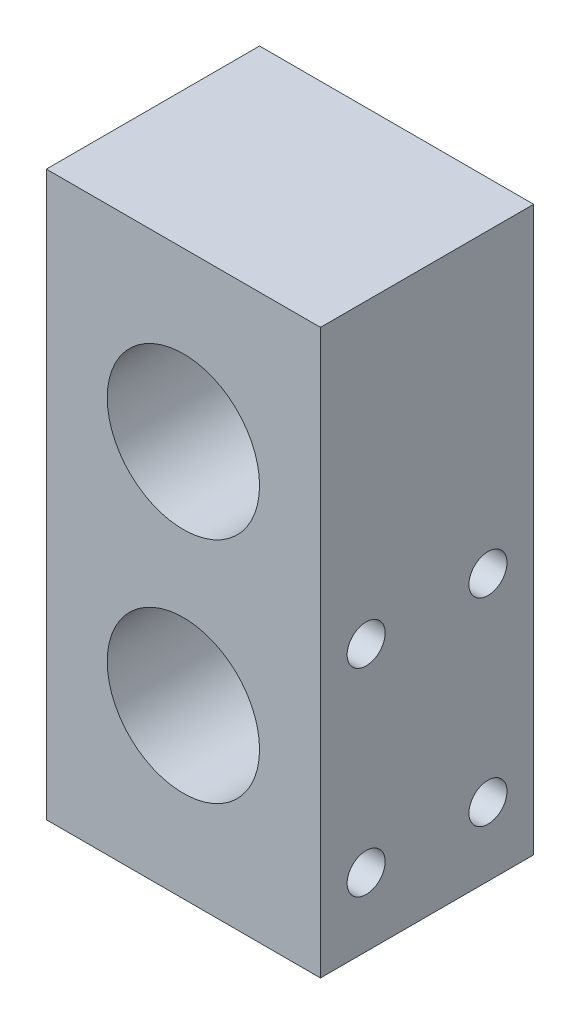
ISO-10303-21;
HEADER;
FILE_DESCRIPTION(('STEP AP214'),'2;1');
FILE_NAME('part.step','',(''),(''),'','','');
FILE_SCHEMA(('AUTOMOTIVE_DESIGN { 1 0 10303 214 1 1 1 1 }'));
ENDSEC;
DATA;
#1=APPLICATION_CONTEXT('core data for automotive mechanical design processes');
#2=APPLICATION_PROTOCOL_DEFINITION('international standard','automotive_design',2000,#1);
#3=PRODUCT_CONTEXT('',#1,'mechanical');
#4=PRODUCT('Part','Part','',(#3));
#5=PRODUCT_RELATED_PRODUCT_CATEGORY('part','',(#4));
#6=PRODUCT_DEFINITION_FORMATION('','',#4);
#7=PRODUCT_DEFINITION_CONTEXT('part definition',#1,'design');
#8=PRODUCT_DEFINITION('design','',#6,#7);
#9=PRODUCT_DEFINITION_SHAPE('','',#8);
#10=(LENGTH_UNIT() NAMED_UNIT(*) SI_UNIT(.MILLI.,.METRE.));
#11=(NAMED_UNIT(*) PLANE_ANGLE_UNIT() SI_UNIT($,.RADIAN.));
#12=(NAMED_UNIT(*) SI_UNIT($,.STERADIAN.) SOLID_ANGLE_UNIT());
#13=UNCERTAINTY_MEASURE_WITH_UNIT(LENGTH_MEASURE(1.E-05),#10,'distance_accuracy_value','');
#14=(GEOMETRIC_REPRESENTATION_CONTEXT(3) GLOBAL_UNCERTAINTY_ASSIGNED_CONTEXT((#13)) GLOBAL_UNIT_ASSIGNED_CONTEXT((#10,
#11,#12)) REPRESENTATION_CONTEXT('',''));
#15=CARTESIAN_POINT('',(0.,0.,0.));
#16=DIRECTION('',(0.,0.,1.));
#17=DIRECTION('',(1.,0.,0.));
#18=AXIS2_PLACEMENT_3D('',#15,#16,#17);
#19=CARTESIAN_POINT('',(9.,37.,7.));
#20=DIRECTION('',(-1.,0.,0.));
#21=DIRECTION('',(0.,0.,1.));
#22=AXIS2_PLACEMENT_3D('',#19,#20,#21);
#23=PLANE('',#22);
#24=CARTESIAN_POINT('',(9.,17.5,-4.));
#25=DIRECTION('',(1.,0.,0.));
#26=DIRECTION('',(0.,0.,-1.));
#27=AXIS2_PLACEMENT_3D('',#24,#25,#26);
#28=CIRCLE('',#27,1.25);
#29=CARTESIAN_POINT('',(9.,17.5,-5.25));
#30=VERTEX_POINT('',#29);
#31=EDGE_CURVE('E128',#30,#30,#28,.T.);
#32=ORIENTED_EDGE('',*,*,#31,.F.);
#33=EDGE_LOOP('',(#32));
#34=FACE_BOUND('',#33,.T.);
#35=CARTESIAN_POINT('',(9.,17.5,4.));
#36=DIRECTION('',(1.,0.,0.));
#37=DIRECTION('',(0.,0.,-1.));
#38=AXIS2_PLACEMENT_3D('',#35,#36,#37);
#39=CIRCLE('',#38,1.25);
#40=CARTESIAN_POINT('',(9.,17.5,2.75));
#41=VERTEX_POINT('',#40);
#42=EDGE_CURVE('E127',#41,#41,#39,.T.);
#43=ORIENTED_EDGE('',*,*,#42,.F.);
#44=EDGE_LOOP('',(#43));
#45=FACE_BOUND('',#44,.T.);
#46=CARTESIAN_POINT('',(9.,4.5,4.));
#47=DIRECTION('',(1.,0.,0.));
#48=DIRECTION('',(0.,0.,-1.));
#49=AXIS2_PLACEMENT_3D('',#46,#47,#48);
#50=CIRCLE('',#49,1.25);
#51=CARTESIAN_POINT('',(9.,4.5,2.75));
#52=VERTEX_POINT('',#51);
#53=EDGE_CURVE('E141',#52,#52,#50,.T.);
#54=ORIENTED_EDGE('',*,*,#53,.F.);
#55=EDGE_LOOP('',(#54));
#56=FACE_BOUND('',#55,.T.);
#57=CARTESIAN_POINT('',(9.,4.5,-4.));
#58=DIRECTION('',(1.,0.,0.));
#59=DIRECTION('',(0.,0.,-1.));
#60=AXIS2_PLACEMENT_3D('',#57,#58,#59);
#61=CIRCLE('',#60,1.25);
#62=CARTESIAN_POINT('',(9.,4.5,-5.25));
#63=VERTEX_POINT('',#62);
#64=EDGE_CURVE('E149',#63,#63,#61,.T.);
#65=ORIENTED_EDGE('',*,*,#64,.F.);
#66=EDGE_LOOP('',(#65));
#67=FACE_BOUND('',#66,.T.);
#68=DIRECTION('',(0.,0.,-1.));
#69=VECTOR('',#68,1.);
#70=CARTESIAN_POINT('',(9.,0.,7.));
#71=LINE('',#70,#69);
#72=CARTESIAN_POINT('',(9.,0.,7.));
#73=VERTEX_POINT('',#72);
#74=CARTESIAN_POINT('',(9.,0.,-7.));
#75=VERTEX_POINT('',#74);
#76=EDGE_CURVE('E194',#73,#75,#71,.T.);
#77=ORIENTED_EDGE('',*,*,#76,.T.);
#78=DIRECTION('',(0.,-1.,0.));
#79=VECTOR('',#78,1.);
#80=CARTESIAN_POINT('',(9.,37.,-7.));
#81=LINE('',#80,#79);
#82=CARTESIAN_POINT('',(9.,37.,-7.));
#83=VERTEX_POINT('',#82);
#84=EDGE_CURVE('E11',#83,#75,#81,.T.);
#85=ORIENTED_EDGE('',*,*,#84,.F.);
#86=DIRECTION('',(0.,0.,-1.));
#87=VECTOR('',#86,1.);
#88=CARTESIAN_POINT('',(9.,37.,7.));
#89=LINE('',#88,#87);
#90=CARTESIAN_POINT('',(9.,37.,7.));
#91=VERTEX_POINT('',#90);
#92=EDGE_CURVE('E206',#91,#83,#89,.T.);
#93=ORIENTED_EDGE('',*,*,#92,.F.);
#94=DIRECTION('',(0.,-1.,0.));
#95=VECTOR('',#94,1.);
#96=CARTESIAN_POINT('',(9.,37.,7.));
#97=LINE('',#96,#95);
#98=EDGE_CURVE('E216',#91,#73,#97,.T.);
#99=ORIENTED_EDGE('',*,*,#98,.T.);
#100=EDGE_LOOP('',(#77,#85,#93,#99));
#101=FACE_BOUND('',#100,.T.);
#102=ADVANCED_FACE('F43',(#34,#45,#56,#67,#101),#23,.F.);
#103=CARTESIAN_POINT('',(-9.,37.,-7.));
#104=DIRECTION('',(0.,0.,1.));
#105=DIRECTION('',(1.,0.,0.));
#106=AXIS2_PLACEMENT_3D('',#103,#104,#105);
#107=PLANE('',#106);
#108=CARTESIAN_POINT('',(0.,26.,-7.));
#109=DIRECTION('',(0.,0.,1.));
#110=DIRECTION('',(1.,0.,0.));
#111=AXIS2_PLACEMENT_3D('',#108,#109,#110);
#112=CIRCLE('',#111,5.);
#113=CARTESIAN_POINT('',(5.,26.,-7.));
#114=VERTEX_POINT('',#113);
#115=EDGE_CURVE('E190',#114,#114,#112,.T.);
#116=ORIENTED_EDGE('',*,*,#115,.T.);
#117=EDGE_LOOP('',(#116));
#118=FACE_BOUND('',#117,.T.);
#119=CARTESIAN_POINT('',(0.,11.,-7.));
#120=DIRECTION('',(0.,0.,1.));
#121=DIRECTION('',(1.,0.,0.));
#122=AXIS2_PLACEMENT_3D('',#119,#120,#121);
#123=CIRCLE('',#122,5.);
#124=CARTESIAN_POINT('',(5.,11.,-7.));
#125=VERTEX_POINT('',#124);
#126=EDGE_CURVE('E199',#125,#125,#123,.T.);
#127=ORIENTED_EDGE('',*,*,#126,.T.);
#128=EDGE_LOOP('',(#127));
#129=FACE_BOUND('',#128,.T.);
#130=DIRECTION('',(-1.,0.,0.));
#131=VECTOR('',#130,1.);
#132=CARTESIAN_POINT('',(-9.,0.,-7.));
#133=LINE('',#132,#131);
#134=CARTESIAN_POINT('',(-9.,0.,-7.));
#135=VERTEX_POINT('',#134);
#136=EDGE_CURVE('E220',#75,#135,#133,.T.);
#137=ORIENTED_EDGE('',*,*,#136,.T.);
#138=DIRECTION('',(0.,-1.,0.));
#139=VECTOR('',#138,1.);
#140=CARTESIAN_POINT('',(-9.,37.,-7.));
#141=LINE('',#140,#139);
#142=CARTESIAN_POINT('',(-9.,37.,-7.));
#143=VERTEX_POINT('',#142);
#144=EDGE_CURVE('E52',#143,#135,#141,.T.);
#145=ORIENTED_EDGE('',*,*,#144,.F.);
#146=DIRECTION('',(-1.,0.,0.));
#147=VECTOR('',#146,1.);
#148=CARTESIAN_POINT('',(-9.,37.,-7.));
#149=LINE('',#148,#147);
#150=EDGE_CURVE('E91',#83,#143,#149,.T.);
#151=ORIENTED_EDGE('',*,*,#150,.F.);
#152=ORIENTED_EDGE('',*,*,#84,.T.);
#153=EDGE_LOOP('',(#137,#145,#151,#152));
#154=FACE_BOUND('',#153,.T.);
#155=ADVANCED_FACE('F250',(#118,#129,#154),#107,.F.);
#156=CARTESIAN_POINT('',(-9.,37.,7.));
#157=DIRECTION('',(1.,0.,0.));
#158=DIRECTION('',(0.,0.,-1.));
#159=AXIS2_PLACEMENT_3D('',#156,#157,#158);
#160=PLANE('',#159);
#161=CARTESIAN_POINT('',(-9.,17.5,-4.));
#162=DIRECTION('',(-1.,0.,0.));
#163=DIRECTION('',(0.,0.,1.));
#164=AXIS2_PLACEMENT_3D('',#161,#162,#163);
#165=CIRCLE('',#164,1.25);
#166=CARTESIAN_POINT('',(-9.,17.5,-2.75));
#167=VERTEX_POINT('',#166);
#168=EDGE_CURVE('E157',#167,#167,#165,.T.);
#169=ORIENTED_EDGE('',*,*,#168,.F.);
#170=EDGE_LOOP('',(#169));
#171=FACE_BOUND('',#170,.T.);
#172=CARTESIAN_POINT('',(-9.,17.5,4.));
#173=DIRECTION('',(-1.,0.,0.));
#174=DIRECTION('',(0.,0.,1.));
#175=AXIS2_PLACEMENT_3D('',#172,#173,#174);
#176=CIRCLE('',#175,1.25);
#177=CARTESIAN_POINT('',(-9.,17.5,5.25));
#178=VERTEX_POINT('',#177);
#179=EDGE_CURVE('E165',#178,#178,#176,.T.);
#180=ORIENTED_EDGE('',*,*,#179,.F.);
#181=EDGE_LOOP('',(#180));
#182=FACE_BOUND('',#181,.T.);
#183=CARTESIAN_POINT('',(-9.,4.5,4.));
#184=DIRECTION('',(-1.,0.,0.));
#185=DIRECTION('',(0.,0.,1.));
#186=AXIS2_PLACEMENT_3D('',#183,#184,#185);
#187=CIRCLE('',#186,1.25);
#188=CARTESIAN_POINT('',(-9.,4.5,5.25));
#189=VERTEX_POINT('',#188);
#190=EDGE_CURVE('E173',#189,#189,#187,.T.);
#191=ORIENTED_EDGE('',*,*,#190,.F.);
#192=EDGE_LOOP('',(#191));
#193=FACE_BOUND('',#192,.T.);
#194=CARTESIAN_POINT('',(-9.,4.5,-4.));
#195=DIRECTION('',(-1.,0.,0.));
#196=DIRECTION('',(0.,0.,1.));
#197=AXIS2_PLACEMENT_3D('',#194,#195,#196);
#198=CIRCLE('',#197,1.25);
#199=CARTESIAN_POINT('',(-9.,4.5,-2.75));
#200=VERTEX_POINT('',#199);
#201=EDGE_CURVE('E181',#200,#200,#198,.T.);
#202=ORIENTED_EDGE('',*,*,#201,.F.);
#203=EDGE_LOOP('',(#202));
#204=FACE_BOUND('',#203,.T.);
#205=DIRECTION('',(0.,0.,1.));
#206=VECTOR('',#205,1.);
#207=CARTESIAN_POINT('',(-9.,0.,7.));
#208=LINE('',#207,#206);
#209=CARTESIAN_POINT('',(-9.,0.,7.));
#210=VERTEX_POINT('',#209);
#211=EDGE_CURVE('E78',#135,#210,#208,.T.);
#212=ORIENTED_EDGE('',*,*,#211,.T.);
#213=DIRECTION('',(0.,-1.,0.));
#214=VECTOR('',#213,1.);
#215=CARTESIAN_POINT('',(-9.,37.,7.));
#216=LINE('',#215,#214);
#217=CARTESIAN_POINT('',(-9.,37.,7.));
#218=VERTEX_POINT('',#217);
#219=EDGE_CURVE('E229',#218,#210,#216,.T.);
#220=ORIENTED_EDGE('',*,*,#219,.F.);
#221=DIRECTION('',(0.,0.,1.));
#222=VECTOR('',#221,1.);
#223=CARTESIAN_POINT('',(-9.,37.,7.));
#224=LINE('',#223,#222);
#225=EDGE_CURVE('E211',#143,#218,#224,.T.);
#226=ORIENTED_EDGE('',*,*,#225,.F.);
#227=ORIENTED_EDGE('',*,*,#144,.T.);
#228=EDGE_LOOP('',(#212,#220,#226,#227));
#229=FACE_BOUND('',#228,.T.);
#230=ADVANCED_FACE('F233',(#171,#182,#193,#204,#229),#160,.F.);
#231=CARTESIAN_POINT('',(-9.,37.,7.));
#232=DIRECTION('',(0.,0.,-1.));
#233=DIRECTION('',(-1.,0.,0.));
#234=AXIS2_PLACEMENT_3D('',#231,#232,#233);
#235=PLANE('',#234);
#236=CARTESIAN_POINT('',(0.,26.,7.));
#237=DIRECTION('',(0.,0.,1.));
#238=DIRECTION('',(1.,0.,0.));
#239=AXIS2_PLACEMENT_3D('',#236,#237,#238);
#240=CIRCLE('',#239,5.);
#241=CARTESIAN_POINT('',(5.,26.,7.));
#242=VERTEX_POINT('',#241);
#243=EDGE_CURVE('E195',#242,#242,#240,.T.);
#244=ORIENTED_EDGE('',*,*,#243,.F.);
#245=EDGE_LOOP('',(#244));
#246=FACE_BOUND('',#245,.T.);
#247=CARTESIAN_POINT('',(0.,11.,7.));
#248=DIRECTION('',(0.,0.,1.));
#249=DIRECTION('',(1.,0.,0.));
#250=AXIS2_PLACEMENT_3D('',#247,#248,#249);
#251=CIRCLE('',#250,5.);
#252=CARTESIAN_POINT('',(5.,11.,7.));
#253=VERTEX_POINT('',#252);
#254=EDGE_CURVE('E189',#253,#253,#251,.T.);
#255=ORIENTED_EDGE('',*,*,#254,.F.);
#256=EDGE_LOOP('',(#255));
#257=FACE_BOUND('',#256,.T.);
#258=DIRECTION('',(1.,0.,0.));
#259=VECTOR('',#258,1.);
#260=CARTESIAN_POINT('',(-9.,0.,7.));
#261=LINE('',#260,#259);
#262=EDGE_CURVE('E84',#210,#73,#261,.T.);
#263=ORIENTED_EDGE('',*,*,#262,.T.);
#264=ORIENTED_EDGE('',*,*,#98,.F.);
#265=DIRECTION('',(1.,0.,0.));
#266=VECTOR('',#265,1.);
#267=CARTESIAN_POINT('',(-9.,37.,7.));
#268=LINE('',#267,#266);
#269=EDGE_CURVE('E60',#218,#91,#268,.T.);
#270=ORIENTED_EDGE('',*,*,#269,.F.);
#271=ORIENTED_EDGE('',*,*,#219,.T.);
#272=EDGE_LOOP('',(#263,#264,#270,#271));
#273=FACE_BOUND('',#272,.T.);
#274=ADVANCED_FACE('F240',(#246,#257,#273),#235,.F.);
#275=CARTESIAN_POINT('',(0.,37.,0.));
#276=DIRECTION('',(0.,-1.,0.));
#277=DIRECTION('',(0.,0.,-1.));
#278=AXIS2_PLACEMENT_3D('',#275,#276,#277);
#279=PLANE('',#278);
#280=ORIENTED_EDGE('',*,*,#92,.T.);
#281=ORIENTED_EDGE('',*,*,#150,.T.);
#282=ORIENTED_EDGE('',*,*,#225,.T.);
#283=ORIENTED_EDGE('',*,*,#269,.T.);
#284=EDGE_LOOP('',(#280,#281,#282,#283));
#285=FACE_BOUND('',#284,.T.);
#286=ADVANCED_FACE('F242',(#285),#279,.F.);
#287=CARTESIAN_POINT('',(0.,0.,0.));
#288=DIRECTION('',(0.,-1.,0.));
#289=DIRECTION('',(0.,0.,-1.));
#290=AXIS2_PLACEMENT_3D('',#287,#288,#289);
#291=PLANE('',#290);
#292=ORIENTED_EDGE('',*,*,#76,.F.);
#293=ORIENTED_EDGE('',*,*,#262,.F.);
#294=ORIENTED_EDGE('',*,*,#211,.F.);
#295=ORIENTED_EDGE('',*,*,#136,.F.);
#296=EDGE_LOOP('',(#292,#293,#294,#295));
#297=FACE_BOUND('',#296,.T.);
#298=ADVANCED_FACE('F236',(#297),#291,.T.);
#299=CARTESIAN_POINT('',(0.,11.,-7.));
#300=DIRECTION('',(0.,0.,1.));
#301=DIRECTION('',(1.,0.,0.));
#302=AXIS2_PLACEMENT_3D('',#299,#300,#301);
#303=CYLINDRICAL_SURFACE('',#302,5.);
#304=ORIENTED_EDGE('',*,*,#126,.F.);
#305=EDGE_LOOP('',(#304));
#306=FACE_BOUND('',#305,.T.);
#307=ORIENTED_EDGE('',*,*,#254,.T.);
#308=EDGE_LOOP('',(#307));
#309=FACE_BOUND('',#308,.T.);
#310=ADVANCED_FACE('F323',(#306,#309),#303,.F.);
#311=CARTESIAN_POINT('',(0.,26.,-7.));
#312=DIRECTION('',(0.,0.,1.));
#313=DIRECTION('',(1.,0.,0.));
#314=AXIS2_PLACEMENT_3D('',#311,#312,#313);
#315=CYLINDRICAL_SURFACE('',#314,5.);
#316=ORIENTED_EDGE('',*,*,#115,.F.);
#317=EDGE_LOOP('',(#316));
#318=FACE_BOUND('',#317,.T.);
#319=ORIENTED_EDGE('',*,*,#243,.T.);
#320=EDGE_LOOP('',(#319));
#321=FACE_BOUND('',#320,.T.);
#322=ADVANCED_FACE('F319',(#318,#321),#315,.F.);
#323=CARTESIAN_POINT('',(-3.5,4.5,-4.));
#324=DIRECTION('',(-1.,0.,0.));
#325=DIRECTION('',(0.,0.,1.));
#326=AXIS2_PLACEMENT_3D('',#323,#324,#325);
#327=CONICAL_SURFACE('',#326,1.25,1.02974425867665);
#328=CARTESIAN_POINT('',(-2.74892422621555,4.5,-4.));
#329=VERTEX_POINT('',#328);
#330=VERTEX_LOOP('',#329);
#331=FACE_BOUND('',#330,.T.);
#332=CARTESIAN_POINT('',(-3.5,4.5,-4.));
#333=DIRECTION('',(-1.,0.,0.));
#334=DIRECTION('',(0.,0.,1.));
#335=AXIS2_PLACEMENT_3D('',#332,#333,#334);
#336=CIRCLE('',#335,1.25);
#337=CARTESIAN_POINT('',(-3.5,4.5,-2.75));
#338=VERTEX_POINT('',#337);
#339=EDGE_CURVE('E185',#338,#338,#336,.T.);
#340=ORIENTED_EDGE('',*,*,#339,.T.);
#341=EDGE_LOOP('',(#340));
#342=FACE_BOUND('',#341,.T.);
#343=ADVANCED_FACE('F315',(#331,#342),#327,.F.);
#344=CARTESIAN_POINT('',(-9.,4.5,-4.));
#345=DIRECTION('',(-1.,0.,0.));
#346=DIRECTION('',(0.,0.,1.));
#347=AXIS2_PLACEMENT_3D('',#344,#345,#346);
#348=CYLINDRICAL_SURFACE('',#347,1.25);
#349=ORIENTED_EDGE('',*,*,#339,.F.);
#350=EDGE_LOOP('',(#349));
#351=FACE_BOUND('',#350,.T.);
#352=ORIENTED_EDGE('',*,*,#201,.T.);
#353=EDGE_LOOP('',(#352));
#354=FACE_BOUND('',#353,.T.);
#355=ADVANCED_FACE('F311',(#351,#354),#348,.F.);
#356=CARTESIAN_POINT('',(-3.5,4.5,4.));
#357=DIRECTION('',(-1.,0.,0.));
#358=DIRECTION('',(0.,0.,1.));
#359=AXIS2_PLACEMENT_3D('',#356,#357,#358);
#360=CONICAL_SURFACE('',#359,1.25,1.02974425867665);
#361=CARTESIAN_POINT('',(-2.74892422621555,4.5,4.));
#362=VERTEX_POINT('',#361);
#363=VERTEX_LOOP('',#362);
#364=FACE_BOUND('',#363,.T.);
#365=CARTESIAN_POINT('',(-3.5,4.5,4.));
#366=DIRECTION('',(-1.,0.,0.));
#367=DIRECTION('',(0.,0.,1.));
#368=AXIS2_PLACEMENT_3D('',#365,#366,#367);
#369=CIRCLE('',#368,1.25);
#370=CARTESIAN_POINT('',(-3.5,4.5,5.25));
#371=VERTEX_POINT('',#370);
#372=EDGE_CURVE('E177',#371,#371,#369,.T.);
#373=ORIENTED_EDGE('',*,*,#372,.T.);
#374=EDGE_LOOP('',(#373));
#375=FACE_BOUND('',#374,.T.);
#376=ADVANCED_FACE('F307',(#364,#375),#360,.F.);
#377=CARTESIAN_POINT('',(-9.,4.5,4.));
#378=DIRECTION('',(-1.,0.,0.));
#379=DIRECTION('',(0.,0.,1.));
#380=AXIS2_PLACEMENT_3D('',#377,#378,#379);
#381=CYLINDRICAL_SURFACE('',#380,1.25);
#382=ORIENTED_EDGE('',*,*,#372,.F.);
#383=EDGE_LOOP('',(#382));
#384=FACE_BOUND('',#383,.T.);
#385=ORIENTED_EDGE('',*,*,#190,.T.);
#386=EDGE_LOOP('',(#385));
#387=FACE_BOUND('',#386,.T.);
#388=ADVANCED_FACE('F303',(#384,#387),#381,.F.);
#389=CARTESIAN_POINT('',(-3.5,17.5,4.));
#390=DIRECTION('',(-1.,0.,0.));
#391=DIRECTION('',(0.,0.,1.));
#392=AXIS2_PLACEMENT_3D('',#389,#390,#391);
#393=CONICAL_SURFACE('',#392,1.25,1.02974425867665);
#394=CARTESIAN_POINT('',(-2.74892422621555,17.5,4.));
#395=VERTEX_POINT('',#394);
#396=VERTEX_LOOP('',#395);
#397=FACE_BOUND('',#396,.T.);
#398=CARTESIAN_POINT('',(-3.5,17.5,4.));
#399=DIRECTION('',(-1.,0.,0.));
#400=DIRECTION('',(0.,0.,1.));
#401=AXIS2_PLACEMENT_3D('',#398,#399,#400);
#402=CIRCLE('',#401,1.25);
#403=CARTESIAN_POINT('',(-3.5,17.5,5.25));
#404=VERTEX_POINT('',#403);
#405=EDGE_CURVE('E169',#404,#404,#402,.T.);
#406=ORIENTED_EDGE('',*,*,#405,.T.);
#407=EDGE_LOOP('',(#406));
#408=FACE_BOUND('',#407,.T.);
#409=ADVANCED_FACE('F299',(#397,#408),#393,.F.);
#410=CARTESIAN_POINT('',(-9.,17.5,4.));
#411=DIRECTION('',(-1.,0.,0.));
#412=DIRECTION('',(0.,0.,1.));
#413=AXIS2_PLACEMENT_3D('',#410,#411,#412);
#414=CYLINDRICAL_SURFACE('',#413,1.25);
#415=ORIENTED_EDGE('',*,*,#405,.F.);
#416=EDGE_LOOP('',(#415));
#417=FACE_BOUND('',#416,.T.);
#418=ORIENTED_EDGE('',*,*,#179,.T.);
#419=EDGE_LOOP('',(#418));
#420=FACE_BOUND('',#419,.T.);
#421=ADVANCED_FACE('F295',(#417,#420),#414,.F.);
#422=CARTESIAN_POINT('',(-3.5,17.5,-4.));
#423=DIRECTION('',(-1.,0.,0.));
#424=DIRECTION('',(0.,0.,1.));
#425=AXIS2_PLACEMENT_3D('',#422,#423,#424);
#426=CONICAL_SURFACE('',#425,1.25,1.02974425867665);
#427=CARTESIAN_POINT('',(-2.74892422621555,17.5,-4.));
#428=VERTEX_POINT('',#427);
#429=VERTEX_LOOP('',#428);
#430=FACE_BOUND('',#429,.T.);
#431=CARTESIAN_POINT('',(-3.5,17.5,-4.));
#432=DIRECTION('',(-1.,0.,0.));
#433=DIRECTION('',(0.,0.,1.));
#434=AXIS2_PLACEMENT_3D('',#431,#432,#433);
#435=CIRCLE('',#434,1.25);
#436=CARTESIAN_POINT('',(-3.5,17.5,-2.75));
#437=VERTEX_POINT('',#436);
#438=EDGE_CURVE('E161',#437,#437,#435,.T.);
#439=ORIENTED_EDGE('',*,*,#438,.T.);
#440=EDGE_LOOP('',(#439));
#441=FACE_BOUND('',#440,.T.);
#442=ADVANCED_FACE('F291',(#430,#441),#426,.F.);
#443=CARTESIAN_POINT('',(-9.,17.5,-4.));
#444=DIRECTION('',(-1.,0.,0.));
#445=DIRECTION('',(0.,0.,1.));
#446=AXIS2_PLACEMENT_3D('',#443,#444,#445);
#447=CYLINDRICAL_SURFACE('',#446,1.25);
#448=ORIENTED_EDGE('',*,*,#438,.F.);
#449=EDGE_LOOP('',(#448));
#450=FACE_BOUND('',#449,.T.);
#451=ORIENTED_EDGE('',*,*,#168,.T.);
#452=EDGE_LOOP('',(#451));
#453=FACE_BOUND('',#452,.T.);
#454=ADVANCED_FACE('F283',(#450,#453),#447,.F.);
#455=CARTESIAN_POINT('',(3.5,4.5,-4.));
#456=DIRECTION('',(1.,0.,0.));
#457=DIRECTION('',(0.,0.,-1.));
#458=AXIS2_PLACEMENT_3D('',#455,#456,#457);
#459=CONICAL_SURFACE('',#458,1.25,1.02974425867665);
#460=CARTESIAN_POINT('',(2.74892422621555,4.5,-4.));
#461=VERTEX_POINT('',#460);
#462=VERTEX_LOOP('',#461);
#463=FACE_BOUND('',#462,.T.);
#464=CARTESIAN_POINT('',(3.5,4.5,-4.));
#465=DIRECTION('',(1.,0.,0.));
#466=DIRECTION('',(0.,0.,-1.));
#467=AXIS2_PLACEMENT_3D('',#464,#465,#466);
#468=CIRCLE('',#467,1.25);
#469=CARTESIAN_POINT('',(3.5,4.5,-5.25));
#470=VERTEX_POINT('',#469);
#471=EDGE_CURVE('E153',#470,#470,#468,.T.);
#472=ORIENTED_EDGE('',*,*,#471,.T.);
#473=EDGE_LOOP('',(#472));
#474=FACE_BOUND('',#473,.T.);
#475=ADVANCED_FACE('F273',(#463,#474),#459,.F.);
#476=CARTESIAN_POINT('',(9.,4.5,-4.));
#477=DIRECTION('',(1.,0.,0.));
#478=DIRECTION('',(0.,0.,-1.));
#479=AXIS2_PLACEMENT_3D('',#476,#477,#478);
#480=CYLINDRICAL_SURFACE('',#479,1.25);
#481=ORIENTED_EDGE('',*,*,#471,.F.);
#482=EDGE_LOOP('',(#481));
#483=FACE_BOUND('',#482,.T.);
#484=ORIENTED_EDGE('',*,*,#64,.T.);
#485=EDGE_LOOP('',(#484));
#486=FACE_BOUND('',#485,.T.);
#487=ADVANCED_FACE('F270',(#483,#486),#480,.F.);
#488=CARTESIAN_POINT('',(3.5,4.5,4.));
#489=DIRECTION('',(1.,0.,0.));
#490=DIRECTION('',(0.,0.,-1.));
#491=AXIS2_PLACEMENT_3D('',#488,#489,#490);
#492=CONICAL_SURFACE('',#491,1.25,1.02974425867665);
#493=CARTESIAN_POINT('',(2.74892422621555,4.5,4.));
#494=VERTEX_POINT('',#493);
#495=VERTEX_LOOP('',#494);
#496=FACE_BOUND('',#495,.T.);
#497=CARTESIAN_POINT('',(3.5,4.5,4.));
#498=DIRECTION('',(1.,0.,0.));
#499=DIRECTION('',(0.,0.,-1.));
#500=AXIS2_PLACEMENT_3D('',#497,#498,#499);
#501=CIRCLE('',#500,1.25);
#502=CARTESIAN_POINT('',(3.5,4.5,2.75));
#503=VERTEX_POINT('',#502);
#504=EDGE_CURVE('E145',#503,#503,#501,.T.);
#505=ORIENTED_EDGE('',*,*,#504,.T.);
#506=EDGE_LOOP('',(#505));
#507=FACE_BOUND('',#506,.T.);
#508=ADVANCED_FACE('F272',(#496,#507),#492,.F.);
#509=CARTESIAN_POINT('',(9.,4.5,4.));
#510=DIRECTION('',(1.,0.,0.));
#511=DIRECTION('',(0.,0.,-1.));
#512=AXIS2_PLACEMENT_3D('',#509,#510,#511);
#513=CYLINDRICAL_SURFACE('',#512,1.25);
#514=ORIENTED_EDGE('',*,*,#504,.F.);
#515=EDGE_LOOP('',(#514));
#516=FACE_BOUND('',#515,.T.);
#517=ORIENTED_EDGE('',*,*,#53,.T.);
#518=EDGE_LOOP('',(#517));
#519=FACE_BOUND('',#518,.T.);
#520=ADVANCED_FACE('F280',(#516,#519),#513,.F.);
#521=CARTESIAN_POINT('',(3.5,17.5,4.));
#522=DIRECTION('',(1.,0.,0.));
#523=DIRECTION('',(0.,0.,-1.));
#524=AXIS2_PLACEMENT_3D('',#521,#522,#523);
#525=CONICAL_SURFACE('',#524,1.25,1.02974425867665);
#526=CARTESIAN_POINT('',(2.74892422621555,17.5,4.));
#527=VERTEX_POINT('',#526);
#528=VERTEX_LOOP('',#527);
#529=FACE_BOUND('',#528,.T.);
#530=CARTESIAN_POINT('',(3.5,17.5,4.));
#531=DIRECTION('',(1.,0.,0.));
#532=DIRECTION('',(0.,0.,-1.));
#533=AXIS2_PLACEMENT_3D('',#530,#531,#532);
#534=CIRCLE('',#533,1.25);
#535=CARTESIAN_POINT('',(3.5,17.5,2.75));
#536=VERTEX_POINT('',#535);
#537=EDGE_CURVE('E133',#536,#536,#534,.T.);
#538=ORIENTED_EDGE('',*,*,#537,.T.);
#539=EDGE_LOOP('',(#538));
#540=FACE_BOUND('',#539,.T.);
#541=ADVANCED_FACE('F410',(#529,#540),#525,.F.);
#542=CARTESIAN_POINT('',(9.,17.5,4.));
#543=DIRECTION('',(1.,0.,0.));
#544=DIRECTION('',(0.,0.,-1.));
#545=AXIS2_PLACEMENT_3D('',#542,#543,#544);
#546=CYLINDRICAL_SURFACE('',#545,1.25);
#547=ORIENTED_EDGE('',*,*,#537,.F.);
#548=EDGE_LOOP('',(#547));
#549=FACE_BOUND('',#548,.T.);
#550=ORIENTED_EDGE('',*,*,#42,.T.);
#551=EDGE_LOOP('',(#550));
#552=FACE_BOUND('',#551,.T.);
#553=ADVANCED_FACE('F120',(#549,#552),#546,.F.);
#554=CARTESIAN_POINT('',(3.5,17.5,-4.));
#555=DIRECTION('',(1.,0.,0.));
#556=DIRECTION('',(0.,0.,-1.));
#557=AXIS2_PLACEMENT_3D('',#554,#555,#556);
#558=CONICAL_SURFACE('',#557,1.25,1.02974425867665);
#559=CARTESIAN_POINT('',(2.74892422621555,17.5,-4.));
#560=VERTEX_POINT('',#559);
#561=VERTEX_LOOP('',#560);
#562=FACE_BOUND('',#561,.T.);
#563=CARTESIAN_POINT('',(3.5,17.5,-4.));
#564=DIRECTION('',(1.,0.,0.));
#565=DIRECTION('',(0.,0.,-1.));
#566=AXIS2_PLACEMENT_3D('',#563,#564,#565);
#567=CIRCLE('',#566,1.25);
#568=CARTESIAN_POINT('',(3.5,17.5,-5.25));
#569=VERTEX_POINT('',#568);
#570=EDGE_CURVE('E124',#569,#569,#567,.T.);
#571=ORIENTED_EDGE('',*,*,#570,.T.);
#572=EDGE_LOOP('',(#571));
#573=FACE_BOUND('',#572,.T.);
#574=ADVANCED_FACE('F116',(#562,#573),#558,.F.);
#575=CARTESIAN_POINT('',(9.,17.5,-4.));
#576=DIRECTION('',(1.,0.,0.));
#577=DIRECTION('',(0.,0.,-1.));
#578=AXIS2_PLACEMENT_3D('',#575,#576,#577);
#579=CYLINDRICAL_SURFACE('',#578,1.25);
#580=ORIENTED_EDGE('',*,*,#570,.F.);
#581=EDGE_LOOP('',(#580));
#582=FACE_BOUND('',#581,.T.);
#583=ORIENTED_EDGE('',*,*,#31,.T.);
#584=EDGE_LOOP('',(#583));
#585=FACE_BOUND('',#584,.T.);
#586=ADVANCED_FACE('F119',(#582,#585),#579,.F.);
#587=CLOSED_SHELL('',(#102,#155,#230,#274,#286,#298,#310,#322,#343,#355,#376,#388,#409,#421,
#442,#454,#475,#487,#508,#520,#541,#553,#574,#586));
#588=MANIFOLD_SOLID_BREP('B2',#587);
#589=ADVANCED_BREP_SHAPE_REPRESENTATION('',(#18,#588),#14);
#590=SHAPE_DEFINITION_REPRESENTATION(#9,#589);
ENDSEC;
END-ISO-10303-21;
